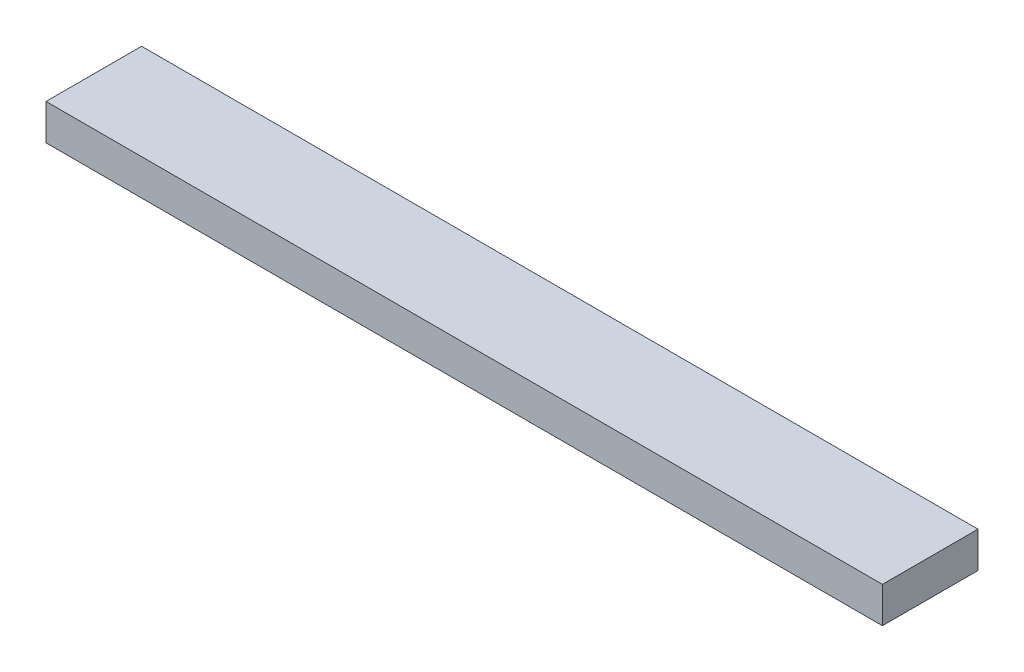
ISO-10303-21;
HEADER;
FILE_DESCRIPTION(('STEP AP214'),'2;1');
FILE_NAME('part.step','',(''),(''),'','','');
FILE_SCHEMA(('AUTOMOTIVE_DESIGN { 1 0 10303 214 1 1 1 1 }'));
ENDSEC;
DATA;
#1=APPLICATION_CONTEXT('core data for automotive mechanical design processes');
#2=APPLICATION_PROTOCOL_DEFINITION('international standard','automotive_design',2000,#1);
#3=PRODUCT_CONTEXT('',#1,'mechanical');
#4=PRODUCT('Part','Part','',(#3));
#5=PRODUCT_RELATED_PRODUCT_CATEGORY('part','',(#4));
#6=PRODUCT_DEFINITION_FORMATION('','',#4);
#7=PRODUCT_DEFINITION_CONTEXT('part definition',#1,'design');
#8=PRODUCT_DEFINITION('design','',#6,#7);
#9=PRODUCT_DEFINITION_SHAPE('','',#8);
#10=(LENGTH_UNIT() NAMED_UNIT(*) SI_UNIT(.MILLI.,.METRE.));
#11=(NAMED_UNIT(*) PLANE_ANGLE_UNIT() SI_UNIT($,.RADIAN.));
#12=(NAMED_UNIT(*) SI_UNIT($,.STERADIAN.) SOLID_ANGLE_UNIT());
#13=UNCERTAINTY_MEASURE_WITH_UNIT(LENGTH_MEASURE(1.E-05),#10,'distance_accuracy_value','');
#14=(GEOMETRIC_REPRESENTATION_CONTEXT(3) GLOBAL_UNCERTAINTY_ASSIGNED_CONTEXT((#13)) GLOBAL_UNIT_ASSIGNED_CONTEXT((#10,
#11,#12)) REPRESENTATION_CONTEXT('',''));
#15=CARTESIAN_POINT('',(0.,0.,0.));
#16=DIRECTION('',(0.,0.,1.));
#17=DIRECTION('',(1.,0.,0.));
#18=AXIS2_PLACEMENT_3D('',#15,#16,#17);
#19=CARTESIAN_POINT('',(350.,-30.,40.));
#20=DIRECTION('',(1.,0.,0.));
#21=DIRECTION('',(0.,0.,-1.));
#22=AXIS2_PLACEMENT_3D('',#19,#20,#21);
#23=PLANE('',#22);
#24=DIRECTION('',(0.,0.,-1.));
#25=VECTOR('',#24,1.);
#26=CARTESIAN_POINT('',(350.,0.,40.));
#27=LINE('',#26,#25);
#28=CARTESIAN_POINT('',(350.,0.,40.));
#29=VERTEX_POINT('',#28);
#30=CARTESIAN_POINT('',(350.,0.,-40.));
#31=VERTEX_POINT('',#30);
#32=EDGE_CURVE('E97',#29,#31,#27,.T.);
#33=ORIENTED_EDGE('',*,*,#32,.F.);
#34=DIRECTION('',(0.,1.,0.));
#35=VECTOR('',#34,1.);
#36=CARTESIAN_POINT('',(350.,-30.,40.));
#37=LINE('',#36,#35);
#38=CARTESIAN_POINT('',(350.,-30.,40.));
#39=VERTEX_POINT('',#38);
#40=EDGE_CURVE('E11',#39,#29,#37,.T.);
#41=ORIENTED_EDGE('',*,*,#40,.F.);
#42=DIRECTION('',(0.,0.,-1.));
#43=VECTOR('',#42,1.);
#44=CARTESIAN_POINT('',(350.,-30.,40.));
#45=LINE('',#44,#43);
#46=CARTESIAN_POINT('',(350.,-30.,-40.));
#47=VERTEX_POINT('',#46);
#48=EDGE_CURVE('E91',#39,#47,#45,.T.);
#49=ORIENTED_EDGE('',*,*,#48,.T.);
#50=DIRECTION('',(0.,1.,0.));
#51=VECTOR('',#50,1.);
#52=CARTESIAN_POINT('',(350.,-30.,-40.));
#53=LINE('',#52,#51);
#54=EDGE_CURVE('E36',#47,#31,#53,.T.);
#55=ORIENTED_EDGE('',*,*,#54,.T.);
#56=EDGE_LOOP('',(#33,#41,#49,#55));
#57=FACE_BOUND('',#56,.T.);
#58=ADVANCED_FACE('F33',(#57),#23,.T.);
#59=CARTESIAN_POINT('',(-350.,-30.,40.));
#60=DIRECTION('',(0.,0.,1.));
#61=DIRECTION('',(1.,0.,0.));
#62=AXIS2_PLACEMENT_3D('',#59,#60,#61);
#63=PLANE('',#62);
#64=DIRECTION('',(1.,0.,0.));
#65=VECTOR('',#64,1.);
#66=CARTESIAN_POINT('',(-350.,0.,40.));
#67=LINE('',#66,#65);
#68=CARTESIAN_POINT('',(-350.,0.,40.));
#69=VERTEX_POINT('',#68);
#70=EDGE_CURVE('E93',#69,#29,#67,.T.);
#71=ORIENTED_EDGE('',*,*,#70,.F.);
#72=DIRECTION('',(0.,1.,0.));
#73=VECTOR('',#72,1.);
#74=CARTESIAN_POINT('',(-350.,-30.,40.));
#75=LINE('',#74,#73);
#76=CARTESIAN_POINT('',(-350.,-30.,40.));
#77=VERTEX_POINT('',#76);
#78=EDGE_CURVE('E42',#77,#69,#75,.T.);
#79=ORIENTED_EDGE('',*,*,#78,.F.);
#80=DIRECTION('',(1.,0.,0.));
#81=VECTOR('',#80,1.);
#82=CARTESIAN_POINT('',(-350.,-30.,40.));
#83=LINE('',#82,#81);
#84=EDGE_CURVE('E88',#77,#39,#83,.T.);
#85=ORIENTED_EDGE('',*,*,#84,.T.);
#86=ORIENTED_EDGE('',*,*,#40,.T.);
#87=EDGE_LOOP('',(#71,#79,#85,#86));
#88=FACE_BOUND('',#87,.T.);
#89=ADVANCED_FACE('F107',(#88),#63,.T.);
#90=CARTESIAN_POINT('',(-350.,-30.,40.));
#91=DIRECTION('',(-1.,0.,0.));
#92=DIRECTION('',(0.,0.,1.));
#93=AXIS2_PLACEMENT_3D('',#90,#91,#92);
#94=PLANE('',#93);
#95=DIRECTION('',(0.,0.,1.));
#96=VECTOR('',#95,1.);
#97=CARTESIAN_POINT('',(-350.,0.,40.));
#98=LINE('',#97,#96);
#99=CARTESIAN_POINT('',(-350.,0.,-40.));
#100=VERTEX_POINT('',#99);
#101=EDGE_CURVE('E83',#100,#69,#98,.T.);
#102=ORIENTED_EDGE('',*,*,#101,.F.);
#103=DIRECTION('',(0.,1.,0.));
#104=VECTOR('',#103,1.);
#105=CARTESIAN_POINT('',(-350.,-30.,-40.));
#106=LINE('',#105,#104);
#107=CARTESIAN_POINT('',(-350.,-30.,-40.));
#108=VERTEX_POINT('',#107);
#109=EDGE_CURVE('E78',#108,#100,#106,.T.);
#110=ORIENTED_EDGE('',*,*,#109,.F.);
#111=DIRECTION('',(0.,0.,1.));
#112=VECTOR('',#111,1.);
#113=CARTESIAN_POINT('',(-350.,-30.,40.));
#114=LINE('',#113,#112);
#115=EDGE_CURVE('E81',#108,#77,#114,.T.);
#116=ORIENTED_EDGE('',*,*,#115,.T.);
#117=ORIENTED_EDGE('',*,*,#78,.T.);
#118=EDGE_LOOP('',(#102,#110,#116,#117));
#119=FACE_BOUND('',#118,.T.);
#120=ADVANCED_FACE('F80',(#119),#94,.T.);
#121=CARTESIAN_POINT('',(-350.,-30.,-40.));
#122=DIRECTION('',(0.,0.,-1.));
#123=DIRECTION('',(-1.,0.,0.));
#124=AXIS2_PLACEMENT_3D('',#121,#122,#123);
#125=PLANE('',#124);
#126=DIRECTION('',(-1.,0.,0.));
#127=VECTOR('',#126,1.);
#128=CARTESIAN_POINT('',(-350.,0.,-40.));
#129=LINE('',#128,#127);
#130=EDGE_CURVE('E100',#31,#100,#129,.T.);
#131=ORIENTED_EDGE('',*,*,#130,.F.);
#132=ORIENTED_EDGE('',*,*,#54,.F.);
#133=DIRECTION('',(-1.,0.,0.));
#134=VECTOR('',#133,1.);
#135=CARTESIAN_POINT('',(-350.,-30.,-40.));
#136=LINE('',#135,#134);
#137=EDGE_CURVE('E87',#47,#108,#136,.T.);
#138=ORIENTED_EDGE('',*,*,#137,.T.);
#139=ORIENTED_EDGE('',*,*,#109,.T.);
#140=EDGE_LOOP('',(#131,#132,#138,#139));
#141=FACE_BOUND('',#140,.T.);
#142=ADVANCED_FACE('F90',(#141),#125,.T.);
#143=CARTESIAN_POINT('',(0.,-30.,0.));
#144=DIRECTION('',(0.,-1.,0.));
#145=DIRECTION('',(0.,0.,-1.));
#146=AXIS2_PLACEMENT_3D('',#143,#144,#145);
#147=PLANE('',#146);
#148=ORIENTED_EDGE('',*,*,#48,.F.);
#149=ORIENTED_EDGE('',*,*,#84,.F.);
#150=ORIENTED_EDGE('',*,*,#115,.F.);
#151=ORIENTED_EDGE('',*,*,#137,.F.);
#152=EDGE_LOOP('',(#148,#149,#150,#151));
#153=FACE_BOUND('',#152,.T.);
#154=ADVANCED_FACE('F86',(#153),#147,.T.);
#155=CARTESIAN_POINT('',(0.,0.,0.));
#156=DIRECTION('',(0.,-1.,0.));
#157=DIRECTION('',(0.,0.,-1.));
#158=AXIS2_PLACEMENT_3D('',#155,#156,#157);
#159=PLANE('',#158);
#160=ORIENTED_EDGE('',*,*,#32,.T.);
#161=ORIENTED_EDGE('',*,*,#130,.T.);
#162=ORIENTED_EDGE('',*,*,#101,.T.);
#163=ORIENTED_EDGE('',*,*,#70,.T.);
#164=EDGE_LOOP('',(#160,#161,#162,#163));
#165=FACE_BOUND('',#164,.T.);
#166=ADVANCED_FACE('F106',(#165),#159,.F.);
#167=CLOSED_SHELL('',(#58,#89,#120,#142,#154,#166));
#168=MANIFOLD_SOLID_BREP('B2',#167);
#169=ADVANCED_BREP_SHAPE_REPRESENTATION('',(#18,#168),#14);
#170=SHAPE_DEFINITION_REPRESENTATION(#9,#169);
ENDSEC;
END-ISO-10303-21;
